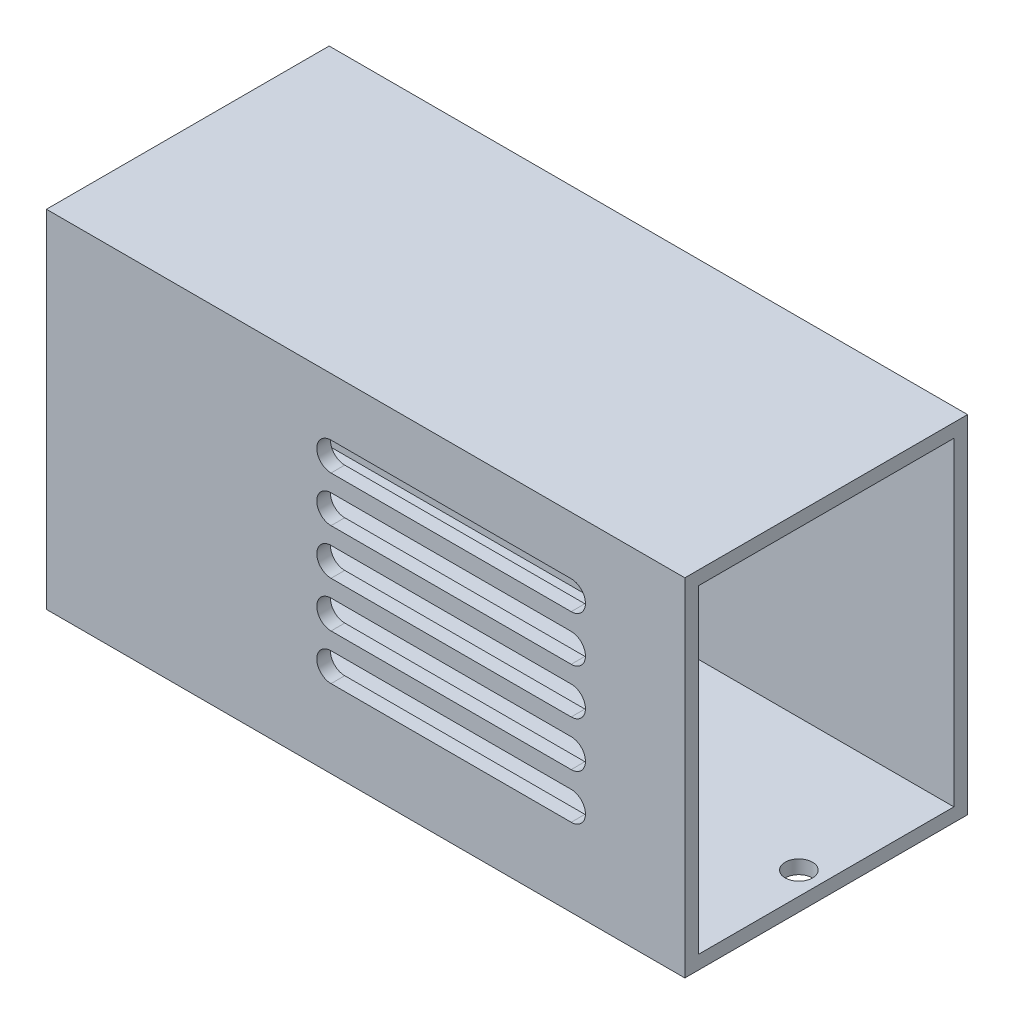
ISO-10303-21;
HEADER;
FILE_DESCRIPTION(('STEP AP214'),'2;1');
FILE_NAME('part.step','',(''),(''),'','','');
FILE_SCHEMA(('AUTOMOTIVE_DESIGN { 1 0 10303 214 1 1 1 1 }'));
ENDSEC;
DATA;
#1=APPLICATION_CONTEXT('core data for automotive mechanical design processes');
#2=APPLICATION_PROTOCOL_DEFINITION('international standard','automotive_design',2000,#1);
#3=PRODUCT_CONTEXT('',#1,'mechanical');
#4=PRODUCT('Part','Part','',(#3));
#5=PRODUCT_RELATED_PRODUCT_CATEGORY('part','',(#4));
#6=PRODUCT_DEFINITION_FORMATION('','',#4);
#7=PRODUCT_DEFINITION_CONTEXT('part definition',#1,'design');
#8=PRODUCT_DEFINITION('design','',#6,#7);
#9=PRODUCT_DEFINITION_SHAPE('','',#8);
#10=(LENGTH_UNIT() NAMED_UNIT(*) SI_UNIT(.MILLI.,.METRE.));
#11=(NAMED_UNIT(*) PLANE_ANGLE_UNIT() SI_UNIT($,.RADIAN.));
#12=(NAMED_UNIT(*) SI_UNIT($,.STERADIAN.) SOLID_ANGLE_UNIT());
#13=UNCERTAINTY_MEASURE_WITH_UNIT(LENGTH_MEASURE(1.E-05),#10,'distance_accuracy_value','');
#14=(GEOMETRIC_REPRESENTATION_CONTEXT(3) GLOBAL_UNCERTAINTY_ASSIGNED_CONTEXT((#13)) GLOBAL_UNIT_ASSIGNED_CONTEXT((#10,
#11,#12)) REPRESENTATION_CONTEXT('',''));
#15=CARTESIAN_POINT('',(0.,0.,0.));
#16=DIRECTION('',(0.,0.,1.));
#17=DIRECTION('',(1.,0.,0.));
#18=AXIS2_PLACEMENT_3D('',#15,#16,#17);
#19=CARTESIAN_POINT('',(35.,19.,31.));
#20=DIRECTION('',(-1.,0.,0.));
#21=DIRECTION('',(0.,0.,1.));
#22=AXIS2_PLACEMENT_3D('',#19,#20,#21);
#23=PLANE('',#22);
#24=DIRECTION('',(0.,0.,1.));
#25=VECTOR('',#24,1.);
#26=CARTESIAN_POINT('',(35.,17.5,29.5));
#27=LINE('',#26,#25);
#28=CARTESIAN_POINT('',(35.,17.5,1.5));
#29=VERTEX_POINT('',#28);
#30=CARTESIAN_POINT('',(35.,17.5,29.5));
#31=VERTEX_POINT('',#30);
#32=EDGE_CURVE('E347',#29,#31,#27,.T.);
#33=ORIENTED_EDGE('',*,*,#32,.F.);
#34=DIRECTION('',(0.,1.,0.));
#35=VECTOR('',#34,1.);
#36=CARTESIAN_POINT('',(35.,17.5,1.5));
#37=LINE('',#36,#35);
#38=CARTESIAN_POINT('',(35.,-17.5,1.5));
#39=VERTEX_POINT('',#38);
#40=EDGE_CURVE('E251',#39,#29,#37,.T.);
#41=ORIENTED_EDGE('',*,*,#40,.F.);
#42=DIRECTION('',(0.,0.,-1.));
#43=VECTOR('',#42,1.);
#44=CARTESIAN_POINT('',(35.,-17.5,29.5));
#45=LINE('',#44,#43);
#46=CARTESIAN_POINT('',(35.,-17.5,29.5));
#47=VERTEX_POINT('',#46);
#48=EDGE_CURVE('E336',#47,#39,#45,.T.);
#49=ORIENTED_EDGE('',*,*,#48,.F.);
#50=DIRECTION('',(0.,-1.,0.));
#51=VECTOR('',#50,1.);
#52=CARTESIAN_POINT('',(35.,17.5,29.5));
#53=LINE('',#52,#51);
#54=EDGE_CURVE('E350',#31,#47,#53,.T.);
#55=ORIENTED_EDGE('',*,*,#54,.F.);
#56=EDGE_LOOP('',(#33,#41,#49,#55));
#57=FACE_BOUND('',#56,.T.);
#58=DIRECTION('',(0.,1.,0.));
#59=VECTOR('',#58,1.);
#60=CARTESIAN_POINT('',(35.,19.,0.));
#61=LINE('',#60,#59);
#62=CARTESIAN_POINT('',(35.,-19.,0.));
#63=VERTEX_POINT('',#62);
#64=CARTESIAN_POINT('',(35.,19.,0.));
#65=VERTEX_POINT('',#64);
#66=EDGE_CURVE('E357',#63,#65,#61,.T.);
#67=ORIENTED_EDGE('',*,*,#66,.T.);
#68=DIRECTION('',(0.,0.,-1.));
#69=VECTOR('',#68,1.);
#70=CARTESIAN_POINT('',(35.,19.,31.));
#71=LINE('',#70,#69);
#72=CARTESIAN_POINT('',(35.,19.,31.));
#73=VERTEX_POINT('',#72);
#74=EDGE_CURVE('E390',#73,#65,#71,.T.);
#75=ORIENTED_EDGE('',*,*,#74,.F.);
#76=DIRECTION('',(0.,1.,0.));
#77=VECTOR('',#76,1.);
#78=CARTESIAN_POINT('',(35.,19.,31.));
#79=LINE('',#78,#77);
#80=CARTESIAN_POINT('',(35.,-19.,31.));
#81=VERTEX_POINT('',#80);
#82=EDGE_CURVE('E364',#81,#73,#79,.T.);
#83=ORIENTED_EDGE('',*,*,#82,.F.);
#84=DIRECTION('',(0.,0.,-1.));
#85=VECTOR('',#84,1.);
#86=CARTESIAN_POINT('',(35.,-19.,31.));
#87=LINE('',#86,#85);
#88=EDGE_CURVE('E374',#81,#63,#87,.T.);
#89=ORIENTED_EDGE('',*,*,#88,.T.);
#90=EDGE_LOOP('',(#67,#75,#83,#89));
#91=FACE_BOUND('',#90,.T.);
#92=ADVANCED_FACE('F34',(#57,#91),#23,.F.);
#93=CARTESIAN_POINT('',(-35.,19.,31.));
#94=DIRECTION('',(0.,-1.,0.));
#95=DIRECTION('',(0.,0.,-1.));
#96=AXIS2_PLACEMENT_3D('',#93,#94,#95);
#97=PLANE('',#96);
#98=DIRECTION('',(-1.,0.,0.));
#99=VECTOR('',#98,1.);
#100=CARTESIAN_POINT('',(-35.,19.,0.));
#101=LINE('',#100,#99);
#102=CARTESIAN_POINT('',(-35.,19.,0.));
#103=VERTEX_POINT('',#102);
#104=EDGE_CURVE('E377',#65,#103,#101,.T.);
#105=ORIENTED_EDGE('',*,*,#104,.T.);
#106=DIRECTION('',(0.,0.,-1.));
#107=VECTOR('',#106,1.);
#108=CARTESIAN_POINT('',(-35.,19.,31.));
#109=LINE('',#108,#107);
#110=CARTESIAN_POINT('',(-35.,19.,31.));
#111=VERTEX_POINT('',#110);
#112=EDGE_CURVE('E387',#111,#103,#109,.T.);
#113=ORIENTED_EDGE('',*,*,#112,.F.);
#114=DIRECTION('',(-1.,0.,0.));
#115=VECTOR('',#114,1.);
#116=CARTESIAN_POINT('',(-35.,19.,31.));
#117=LINE('',#116,#115);
#118=EDGE_CURVE('E367',#73,#111,#117,.T.);
#119=ORIENTED_EDGE('',*,*,#118,.F.);
#120=ORIENTED_EDGE('',*,*,#74,.T.);
#121=EDGE_LOOP('',(#105,#113,#119,#120));
#122=FACE_BOUND('',#121,.T.);
#123=ADVANCED_FACE('F482',(#122),#97,.F.);
#124=CARTESIAN_POINT('',(-35.,19.,31.));
#125=DIRECTION('',(1.,0.,0.));
#126=DIRECTION('',(0.,0.,-1.));
#127=AXIS2_PLACEMENT_3D('',#124,#125,#126);
#128=PLANE('',#127);
#129=DIRECTION('',(0.,0.,-1.));
#130=VECTOR('',#129,1.);
#131=CARTESIAN_POINT('',(-35.,-17.5,29.5));
#132=LINE('',#131,#130);
#133=CARTESIAN_POINT('',(-35.,-17.5,29.5));
#134=VERTEX_POINT('',#133);
#135=CARTESIAN_POINT('',(-35.,-17.5,1.5));
#136=VERTEX_POINT('',#135);
#137=EDGE_CURVE('E342',#134,#136,#132,.T.);
#138=ORIENTED_EDGE('',*,*,#137,.T.);
#139=DIRECTION('',(0.,1.,0.));
#140=VECTOR('',#139,1.);
#141=CARTESIAN_POINT('',(-35.,17.5,1.5));
#142=LINE('',#141,#140);
#143=CARTESIAN_POINT('',(-35.,17.5,1.5));
#144=VERTEX_POINT('',#143);
#145=EDGE_CURVE('E332',#136,#144,#142,.T.);
#146=ORIENTED_EDGE('',*,*,#145,.T.);
#147=DIRECTION('',(0.,0.,1.));
#148=VECTOR('',#147,1.);
#149=CARTESIAN_POINT('',(-35.,17.5,29.5));
#150=LINE('',#149,#148);
#151=CARTESIAN_POINT('',(-35.,17.5,29.5));
#152=VERTEX_POINT('',#151);
#153=EDGE_CURVE('E335',#144,#152,#150,.T.);
#154=ORIENTED_EDGE('',*,*,#153,.T.);
#155=DIRECTION('',(0.,-1.,0.));
#156=VECTOR('',#155,1.);
#157=CARTESIAN_POINT('',(-35.,17.5,29.5));
#158=LINE('',#157,#156);
#159=EDGE_CURVE('E339',#152,#134,#158,.T.);
#160=ORIENTED_EDGE('',*,*,#159,.T.);
#161=EDGE_LOOP('',(#138,#146,#154,#160));
#162=FACE_BOUND('',#161,.T.);
#163=DIRECTION('',(0.,-1.,0.));
#164=VECTOR('',#163,1.);
#165=CARTESIAN_POINT('',(-35.,19.,0.));
#166=LINE('',#165,#164);
#167=CARTESIAN_POINT('',(-35.,-19.,0.));
#168=VERTEX_POINT('',#167);
#169=EDGE_CURVE('E379',#103,#168,#166,.T.);
#170=ORIENTED_EDGE('',*,*,#169,.T.);
#171=DIRECTION('',(0.,0.,-1.));
#172=VECTOR('',#171,1.);
#173=CARTESIAN_POINT('',(-35.,-19.,31.));
#174=LINE('',#173,#172);
#175=CARTESIAN_POINT('',(-35.,-19.,31.));
#176=VERTEX_POINT('',#175);
#177=EDGE_CURVE('E384',#176,#168,#174,.T.);
#178=ORIENTED_EDGE('',*,*,#177,.F.);
#179=DIRECTION('',(0.,-1.,0.));
#180=VECTOR('',#179,1.);
#181=CARTESIAN_POINT('',(-35.,19.,31.));
#182=LINE('',#181,#180);
#183=EDGE_CURVE('E370',#111,#176,#182,.T.);
#184=ORIENTED_EDGE('',*,*,#183,.F.);
#185=ORIENTED_EDGE('',*,*,#112,.T.);
#186=EDGE_LOOP('',(#170,#178,#184,#185));
#187=FACE_BOUND('',#186,.T.);
#188=ADVANCED_FACE('F466',(#162,#187),#128,.F.);
#189=CARTESIAN_POINT('',(-35.,-19.,31.));
#190=DIRECTION('',(0.,1.,0.));
#191=DIRECTION('',(0.,0.,1.));
#192=AXIS2_PLACEMENT_3D('',#189,#190,#191);
#193=PLANE('',#192);
#194=CARTESIAN_POINT('',(-32.5,-19.,16.));
#195=DIRECTION('',(0.,-1.,0.));
#196=DIRECTION('',(0.,0.,-1.));
#197=AXIS2_PLACEMENT_3D('',#194,#195,#196);
#198=CIRCLE('',#197,1.5);
#199=CARTESIAN_POINT('',(-32.5,-19.,14.5));
#200=VERTEX_POINT('',#199);
#201=EDGE_CURVE('E447',#200,#200,#198,.T.);
#202=ORIENTED_EDGE('',*,*,#201,.F.);
#203=EDGE_LOOP('',(#202));
#204=FACE_BOUND('',#203,.T.);
#205=CARTESIAN_POINT('',(32.5,-19.,16.));
#206=DIRECTION('',(0.,-1.,0.));
#207=DIRECTION('',(0.,0.,-1.));
#208=AXIS2_PLACEMENT_3D('',#205,#206,#207);
#209=CIRCLE('',#208,1.5);
#210=CARTESIAN_POINT('',(32.5,-19.,14.5));
#211=VERTEX_POINT('',#210);
#212=EDGE_CURVE('E452',#211,#211,#209,.T.);
#213=ORIENTED_EDGE('',*,*,#212,.F.);
#214=EDGE_LOOP('',(#213));
#215=FACE_BOUND('',#214,.T.);
#216=DIRECTION('',(1.,0.,0.));
#217=VECTOR('',#216,1.);
#218=CARTESIAN_POINT('',(-35.,-19.,0.));
#219=LINE('',#218,#217);
#220=EDGE_CURVE('E368',#168,#63,#219,.T.);
#221=ORIENTED_EDGE('',*,*,#220,.T.);
#222=ORIENTED_EDGE('',*,*,#88,.F.);
#223=DIRECTION('',(1.,0.,0.));
#224=VECTOR('',#223,1.);
#225=CARTESIAN_POINT('',(-35.,-19.,31.));
#226=LINE('',#225,#224);
#227=EDGE_CURVE('E372',#176,#81,#226,.T.);
#228=ORIENTED_EDGE('',*,*,#227,.F.);
#229=ORIENTED_EDGE('',*,*,#177,.T.);
#230=EDGE_LOOP('',(#221,#222,#228,#229));
#231=FACE_BOUND('',#230,.T.);
#232=ADVANCED_FACE('F463',(#204,#215,#231),#193,.F.);
#233=CARTESIAN_POINT('',(0.,0.,31.));
#234=DIRECTION('',(0.,0.,1.));
#235=DIRECTION('',(1.,0.,0.));
#236=AXIS2_PLACEMENT_3D('',#233,#234,#235);
#237=PLANE('',#236);
#238=CARTESIAN_POINT('',(-3.79351902215155,11.1202175257189,31.));
#239=DIRECTION('',(0.,0.,1.));
#240=DIRECTION('',(1.,0.,0.));
#241=AXIS2_PLACEMENT_3D('',#238,#239,#240);
#242=CIRCLE('',#241,1.56203724441535);
#243=CARTESIAN_POINT('',(-3.79351902215155,12.6822547701342,31.));
#244=VERTEX_POINT('',#243);
#245=CARTESIAN_POINT('',(-3.79351902215155,9.55818028130355,31.));
#246=VERTEX_POINT('',#245);
#247=EDGE_CURVE('E50',#244,#246,#242,.T.);
#248=ORIENTED_EDGE('',*,*,#247,.F.);
#249=DIRECTION('',(-1.,0.,0.));
#250=VECTOR('',#249,1.);
#251=CARTESIAN_POINT('',(-3.79351902215155,12.6822547701342,31.));
#252=LINE('',#251,#250);
#253=CARTESIAN_POINT('',(22.5379659551357,12.6822547701342,31.));
#254=VERTEX_POINT('',#253);
#255=EDGE_CURVE('E244',#254,#244,#252,.T.);
#256=ORIENTED_EDGE('',*,*,#255,.F.);
#257=CARTESIAN_POINT('',(22.5379659551357,11.1202175257189,31.));
#258=DIRECTION('',(0.,0.,1.));
#259=DIRECTION('',(1.,0.,0.));
#260=AXIS2_PLACEMENT_3D('',#257,#258,#259);
#261=CIRCLE('',#260,1.56203724441535);
#262=CARTESIAN_POINT('',(22.5379659551357,9.55818028130355,31.));
#263=VERTEX_POINT('',#262);
#264=EDGE_CURVE('E227',#263,#254,#261,.T.);
#265=ORIENTED_EDGE('',*,*,#264,.F.);
#266=DIRECTION('',(1.,0.,0.));
#267=VECTOR('',#266,1.);
#268=CARTESIAN_POINT('',(-3.79351902215155,9.55818028130355,31.));
#269=LINE('',#268,#267);
#270=EDGE_CURVE('E237',#246,#263,#269,.T.);
#271=ORIENTED_EDGE('',*,*,#270,.F.);
#272=EDGE_LOOP('',(#248,#256,#265,#271));
#273=FACE_BOUND('',#272,.T.);
#274=CARTESIAN_POINT('',(-3.7935190221515,6.1202175257189,31.));
#275=DIRECTION('',(0.,0.,1.));
#276=DIRECTION('',(1.,0.,0.));
#277=AXIS2_PLACEMENT_3D('',#274,#275,#276);
#278=CIRCLE('',#277,1.56203724441535);
#279=CARTESIAN_POINT('',(-3.7935190221515,7.68225477013425,31.));
#280=VERTEX_POINT('',#279);
#281=CARTESIAN_POINT('',(-3.7935190221515,4.55818028130355,31.));
#282=VERTEX_POINT('',#281);
#283=EDGE_CURVE('E58',#280,#282,#278,.T.);
#284=ORIENTED_EDGE('',*,*,#283,.F.);
#285=DIRECTION('',(-1.,0.,0.));
#286=VECTOR('',#285,1.);
#287=CARTESIAN_POINT('',(-3.7935190221515,7.68225477013425,31.));
#288=LINE('',#287,#286);
#289=CARTESIAN_POINT('',(22.5379659551358,7.68225477013425,31.));
#290=VERTEX_POINT('',#289);
#291=EDGE_CURVE('E262',#290,#280,#288,.T.);
#292=ORIENTED_EDGE('',*,*,#291,.F.);
#293=CARTESIAN_POINT('',(22.5379659551358,6.1202175257189,31.));
#294=DIRECTION('',(0.,0.,1.));
#295=DIRECTION('',(1.,0.,0.));
#296=AXIS2_PLACEMENT_3D('',#293,#294,#295);
#297=CIRCLE('',#296,1.56203724441535);
#298=CARTESIAN_POINT('',(22.5379659551358,4.55818028130355,31.));
#299=VERTEX_POINT('',#298);
#300=EDGE_CURVE('E259',#299,#290,#297,.T.);
#301=ORIENTED_EDGE('',*,*,#300,.F.);
#302=DIRECTION('',(1.,0.,0.));
#303=VECTOR('',#302,1.);
#304=CARTESIAN_POINT('',(-3.7935190221515,4.55818028130355,31.));
#305=LINE('',#304,#303);
#306=EDGE_CURVE('E255',#282,#299,#305,.T.);
#307=ORIENTED_EDGE('',*,*,#306,.F.);
#308=EDGE_LOOP('',(#284,#292,#301,#307));
#309=FACE_BOUND('',#308,.T.);
#310=CARTESIAN_POINT('',(-3.79351902215145,1.1202175257189,31.));
#311=DIRECTION('',(0.,0.,1.));
#312=DIRECTION('',(1.,0.,0.));
#313=AXIS2_PLACEMENT_3D('',#310,#311,#312);
#314=CIRCLE('',#313,1.56203724441535);
#315=CARTESIAN_POINT('',(-3.79351902215145,2.68225477013425,31.));
#316=VERTEX_POINT('',#315);
#317=CARTESIAN_POINT('',(-3.79351902215145,-0.441819718696449,31.));
#318=VERTEX_POINT('',#317);
#319=EDGE_CURVE('E273',#316,#318,#314,.T.);
#320=ORIENTED_EDGE('',*,*,#319,.F.);
#321=DIRECTION('',(-1.,0.,0.));
#322=VECTOR('',#321,1.);
#323=CARTESIAN_POINT('',(-3.79351902215145,2.68225477013425,31.));
#324=LINE('',#323,#322);
#325=CARTESIAN_POINT('',(22.5379659551358,2.68225477013425,31.));
#326=VERTEX_POINT('',#325);
#327=EDGE_CURVE('E282',#326,#316,#324,.T.);
#328=ORIENTED_EDGE('',*,*,#327,.F.);
#329=CARTESIAN_POINT('',(22.5379659551358,1.1202175257189,31.));
#330=DIRECTION('',(0.,0.,1.));
#331=DIRECTION('',(1.,0.,0.));
#332=AXIS2_PLACEMENT_3D('',#329,#330,#331);
#333=CIRCLE('',#332,1.56203724441535);
#334=CARTESIAN_POINT('',(22.5379659551358,-0.441819718696449,31.));
#335=VERTEX_POINT('',#334);
#336=EDGE_CURVE('E279',#335,#326,#333,.T.);
#337=ORIENTED_EDGE('',*,*,#336,.F.);
#338=DIRECTION('',(1.,0.,0.));
#339=VECTOR('',#338,1.);
#340=CARTESIAN_POINT('',(-3.79351902215145,-0.441819718696449,31.));
#341=LINE('',#340,#339);
#342=EDGE_CURVE('E275',#318,#335,#341,.T.);
#343=ORIENTED_EDGE('',*,*,#342,.F.);
#344=EDGE_LOOP('',(#320,#328,#337,#343));
#345=FACE_BOUND('',#344,.T.);
#346=CARTESIAN_POINT('',(-3.7935190221514,-3.8797824742811,31.));
#347=DIRECTION('',(0.,0.,1.));
#348=DIRECTION('',(1.,0.,0.));
#349=AXIS2_PLACEMENT_3D('',#346,#347,#348);
#350=CIRCLE('',#349,1.56203724441535);
#351=CARTESIAN_POINT('',(-3.7935190221514,-2.31774522986575,31.));
#352=VERTEX_POINT('',#351);
#353=CARTESIAN_POINT('',(-3.7935190221514,-5.44181971869645,31.));
#354=VERTEX_POINT('',#353);
#355=EDGE_CURVE('E293',#352,#354,#350,.T.);
#356=ORIENTED_EDGE('',*,*,#355,.F.);
#357=DIRECTION('',(-1.,0.,0.));
#358=VECTOR('',#357,1.);
#359=CARTESIAN_POINT('',(-3.7935190221514,-2.31774522986575,31.));
#360=LINE('',#359,#358);
#361=CARTESIAN_POINT('',(22.5379659551359,-2.31774522986575,31.));
#362=VERTEX_POINT('',#361);
#363=EDGE_CURVE('E302',#362,#352,#360,.T.);
#364=ORIENTED_EDGE('',*,*,#363,.F.);
#365=CARTESIAN_POINT('',(22.5379659551359,-3.8797824742811,31.));
#366=DIRECTION('',(0.,0.,1.));
#367=DIRECTION('',(1.,0.,0.));
#368=AXIS2_PLACEMENT_3D('',#365,#366,#367);
#369=CIRCLE('',#368,1.56203724441535);
#370=CARTESIAN_POINT('',(22.5379659551359,-5.44181971869645,31.));
#371=VERTEX_POINT('',#370);
#372=EDGE_CURVE('E299',#371,#362,#369,.T.);
#373=ORIENTED_EDGE('',*,*,#372,.F.);
#374=DIRECTION('',(1.,0.,0.));
#375=VECTOR('',#374,1.);
#376=CARTESIAN_POINT('',(-3.7935190221514,-5.44181971869645,31.));
#377=LINE('',#376,#375);
#378=EDGE_CURVE('E295',#354,#371,#377,.T.);
#379=ORIENTED_EDGE('',*,*,#378,.F.);
#380=EDGE_LOOP('',(#356,#364,#373,#379));
#381=FACE_BOUND('',#380,.T.);
#382=CARTESIAN_POINT('',(-3.79351902215135,-8.8797824742811,31.));
#383=DIRECTION('',(0.,0.,1.));
#384=DIRECTION('',(1.,0.,0.));
#385=AXIS2_PLACEMENT_3D('',#382,#383,#384);
#386=CIRCLE('',#385,1.56203724441535);
#387=CARTESIAN_POINT('',(-3.79351902215135,-7.31774522986575,31.));
#388=VERTEX_POINT('',#387);
#389=CARTESIAN_POINT('',(-3.79351902215135,-10.4418197186964,31.));
#390=VERTEX_POINT('',#389);
#391=EDGE_CURVE('E313',#388,#390,#386,.T.);
#392=ORIENTED_EDGE('',*,*,#391,.F.);
#393=DIRECTION('',(-1.,0.,0.));
#394=VECTOR('',#393,1.);
#395=CARTESIAN_POINT('',(-3.79351902215135,-7.31774522986575,31.));
#396=LINE('',#395,#394);
#397=CARTESIAN_POINT('',(22.5379659551359,-7.31774522986575,31.));
#398=VERTEX_POINT('',#397);
#399=EDGE_CURVE('E321',#398,#388,#396,.T.);
#400=ORIENTED_EDGE('',*,*,#399,.F.);
#401=CARTESIAN_POINT('',(22.5379659551359,-8.8797824742811,31.));
#402=DIRECTION('',(0.,0.,1.));
#403=DIRECTION('',(1.,0.,0.));
#404=AXIS2_PLACEMENT_3D('',#401,#402,#403);
#405=CIRCLE('',#404,1.56203724441535);
#406=CARTESIAN_POINT('',(22.5379659551359,-10.4418197186964,31.));
#407=VERTEX_POINT('',#406);
#408=EDGE_CURVE('E318',#407,#398,#405,.T.);
#409=ORIENTED_EDGE('',*,*,#408,.F.);
#410=DIRECTION('',(1.,0.,0.));
#411=VECTOR('',#410,1.);
#412=CARTESIAN_POINT('',(-3.79351902215135,-10.4418197186964,31.));
#413=LINE('',#412,#411);
#414=EDGE_CURVE('E315',#390,#407,#413,.T.);
#415=ORIENTED_EDGE('',*,*,#414,.F.);
#416=EDGE_LOOP('',(#392,#400,#409,#415));
#417=FACE_BOUND('',#416,.T.);
#418=ORIENTED_EDGE('',*,*,#82,.T.);
#419=ORIENTED_EDGE('',*,*,#118,.T.);
#420=ORIENTED_EDGE('',*,*,#183,.T.);
#421=ORIENTED_EDGE('',*,*,#227,.T.);
#422=EDGE_LOOP('',(#418,#419,#420,#421));
#423=FACE_BOUND('',#422,.T.);
#424=ADVANCED_FACE('F241',(#273,#309,#345,#381,#417,#423),#237,.T.);
#425=CARTESIAN_POINT('',(0.,0.,0.));
#426=DIRECTION('',(0.,0.,1.));
#427=DIRECTION('',(1.,0.,0.));
#428=AXIS2_PLACEMENT_3D('',#425,#426,#427);
#429=PLANE('',#428);
#430=ORIENTED_EDGE('',*,*,#66,.F.);
#431=ORIENTED_EDGE('',*,*,#220,.F.);
#432=ORIENTED_EDGE('',*,*,#169,.F.);
#433=ORIENTED_EDGE('',*,*,#104,.F.);
#434=EDGE_LOOP('',(#430,#431,#432,#433));
#435=FACE_BOUND('',#434,.T.);
#436=ADVANCED_FACE('F479',(#435),#429,.F.);
#437=CARTESIAN_POINT('',(-35.,17.5,1.5));
#438=DIRECTION('',(0.,0.,-1.));
#439=DIRECTION('',(0.,1.,0.));
#440=AXIS2_PLACEMENT_3D('',#437,#438,#439);
#441=PLANE('',#440);
#442=ORIENTED_EDGE('',*,*,#40,.T.);
#443=DIRECTION('',(1.,0.,0.));
#444=VECTOR('',#443,1.);
#445=CARTESIAN_POINT('',(-35.,17.5,1.5));
#446=LINE('',#445,#444);
#447=EDGE_CURVE('E345',#144,#29,#446,.T.);
#448=ORIENTED_EDGE('',*,*,#447,.F.);
#449=ORIENTED_EDGE('',*,*,#145,.F.);
#450=DIRECTION('',(1.,0.,0.));
#451=VECTOR('',#450,1.);
#452=CARTESIAN_POINT('',(-35.,-17.5,1.5));
#453=LINE('',#452,#451);
#454=EDGE_CURVE('E355',#136,#39,#453,.T.);
#455=ORIENTED_EDGE('',*,*,#454,.T.);
#456=EDGE_LOOP('',(#442,#448,#449,#455));
#457=FACE_BOUND('',#456,.T.);
#458=ADVANCED_FACE('F506',(#457),#441,.F.);
#459=CARTESIAN_POINT('',(-35.,-17.5,29.5));
#460=DIRECTION('',(0.,-1.,0.));
#461=DIRECTION('',(0.,0.,-1.));
#462=AXIS2_PLACEMENT_3D('',#459,#460,#461);
#463=PLANE('',#462);
#464=CARTESIAN_POINT('',(-32.5,-17.5,16.));
#465=DIRECTION('',(0.,-1.,0.));
#466=DIRECTION('',(0.,0.,-1.));
#467=AXIS2_PLACEMENT_3D('',#464,#465,#466);
#468=CIRCLE('',#467,1.5);
#469=CARTESIAN_POINT('',(-32.5,-17.5,14.5));
#470=VERTEX_POINT('',#469);
#471=EDGE_CURVE('E37',#470,#470,#468,.T.);
#472=ORIENTED_EDGE('',*,*,#471,.T.);
#473=EDGE_LOOP('',(#472));
#474=FACE_BOUND('',#473,.T.);
#475=CARTESIAN_POINT('',(32.5,-17.5,16.));
#476=DIRECTION('',(0.,-1.,0.));
#477=DIRECTION('',(0.,0.,-1.));
#478=AXIS2_PLACEMENT_3D('',#475,#476,#477);
#479=CIRCLE('',#478,1.5);
#480=CARTESIAN_POINT('',(32.5,-17.5,14.5));
#481=VERTEX_POINT('',#480);
#482=EDGE_CURVE('E445',#481,#481,#479,.T.);
#483=ORIENTED_EDGE('',*,*,#482,.T.);
#484=EDGE_LOOP('',(#483));
#485=FACE_BOUND('',#484,.T.);
#486=ORIENTED_EDGE('',*,*,#48,.T.);
#487=ORIENTED_EDGE('',*,*,#454,.F.);
#488=ORIENTED_EDGE('',*,*,#137,.F.);
#489=DIRECTION('',(1.,0.,0.));
#490=VECTOR('',#489,1.);
#491=CARTESIAN_POINT('',(-35.,-17.5,29.5));
#492=LINE('',#491,#490);
#493=EDGE_CURVE('E358',#134,#47,#492,.T.);
#494=ORIENTED_EDGE('',*,*,#493,.T.);
#495=EDGE_LOOP('',(#486,#487,#488,#494));
#496=FACE_BOUND('',#495,.T.);
#497=ADVANCED_FACE('F509',(#474,#485,#496),#463,.F.);
#498=CARTESIAN_POINT('',(-35.,17.5,29.5));
#499=DIRECTION('',(0.,0.,1.));
#500=DIRECTION('',(0.,-1.,0.));
#501=AXIS2_PLACEMENT_3D('',#498,#499,#500);
#502=PLANE('',#501);
#503=DIRECTION('',(-1.,0.,0.));
#504=VECTOR('',#503,1.);
#505=CARTESIAN_POINT('',(-35.,12.6822547701342,29.5));
#506=LINE('',#505,#504);
#507=CARTESIAN_POINT('',(22.5379659551357,12.6822547701342,29.5));
#508=VERTEX_POINT('',#507);
#509=CARTESIAN_POINT('',(-3.79351902215155,12.6822547701342,29.5));
#510=VERTEX_POINT('',#509);
#511=EDGE_CURVE('E42',#508,#510,#506,.T.);
#512=ORIENTED_EDGE('',*,*,#511,.T.);
#513=CARTESIAN_POINT('',(-3.79351902215155,11.1202175257189,29.5));
#514=DIRECTION('',(0.,0.,1.));
#515=DIRECTION('',(0.,-1.,0.));
#516=AXIS2_PLACEMENT_3D('',#513,#514,#515);
#517=CIRCLE('',#516,1.56203724441535);
#518=CARTESIAN_POINT('',(-3.79351902215155,9.55818028130355,29.5));
#519=VERTEX_POINT('',#518);
#520=EDGE_CURVE('E11',#510,#519,#517,.T.);
#521=ORIENTED_EDGE('',*,*,#520,.T.);
#522=DIRECTION('',(1.,0.,0.));
#523=VECTOR('',#522,1.);
#524=CARTESIAN_POINT('',(-35.,9.55818028130355,29.5));
#525=LINE('',#524,#523);
#526=CARTESIAN_POINT('',(22.5379659551357,9.55818028130355,29.5));
#527=VERTEX_POINT('',#526);
#528=EDGE_CURVE('E441',#519,#527,#525,.T.);
#529=ORIENTED_EDGE('',*,*,#528,.T.);
#530=CARTESIAN_POINT('',(22.5379659551357,11.1202175257189,29.5));
#531=DIRECTION('',(0.,0.,1.));
#532=DIRECTION('',(0.,-1.,0.));
#533=AXIS2_PLACEMENT_3D('',#530,#531,#532);
#534=CIRCLE('',#533,1.56203724441535);
#535=EDGE_CURVE('E230',#527,#508,#534,.T.);
#536=ORIENTED_EDGE('',*,*,#535,.T.);
#537=EDGE_LOOP('',(#512,#521,#529,#536));
#538=FACE_BOUND('',#537,.T.);
#539=DIRECTION('',(-1.,0.,0.));
#540=VECTOR('',#539,1.);
#541=CARTESIAN_POINT('',(-35.,7.68225477013425,29.5));
#542=LINE('',#541,#540);
#543=CARTESIAN_POINT('',(22.5379659551358,7.68225477013425,29.5));
#544=VERTEX_POINT('',#543);
#545=CARTESIAN_POINT('',(-3.7935190221515,7.68225477013425,29.5));
#546=VERTEX_POINT('',#545);
#547=EDGE_CURVE('E435',#544,#546,#542,.T.);
#548=ORIENTED_EDGE('',*,*,#547,.T.);
#549=CARTESIAN_POINT('',(-3.7935190221515,6.1202175257189,29.5));
#550=DIRECTION('',(0.,0.,1.));
#551=DIRECTION('',(0.,-1.,0.));
#552=AXIS2_PLACEMENT_3D('',#549,#550,#551);
#553=CIRCLE('',#552,1.56203724441535);
#554=CARTESIAN_POINT('',(-3.7935190221515,4.55818028130355,29.5));
#555=VERTEX_POINT('',#554);
#556=EDGE_CURVE('E438',#546,#555,#553,.T.);
#557=ORIENTED_EDGE('',*,*,#556,.T.);
#558=DIRECTION('',(1.,0.,0.));
#559=VECTOR('',#558,1.);
#560=CARTESIAN_POINT('',(-35.,4.55818028130355,29.5));
#561=LINE('',#560,#559);
#562=CARTESIAN_POINT('',(22.5379659551358,4.55818028130355,29.5));
#563=VERTEX_POINT('',#562);
#564=EDGE_CURVE('E429',#555,#563,#561,.T.);
#565=ORIENTED_EDGE('',*,*,#564,.T.);
#566=CARTESIAN_POINT('',(22.5379659551358,6.1202175257189,29.5));
#567=DIRECTION('',(0.,0.,1.));
#568=DIRECTION('',(0.,-1.,0.));
#569=AXIS2_PLACEMENT_3D('',#566,#567,#568);
#570=CIRCLE('',#569,1.56203724441535);
#571=EDGE_CURVE('E432',#563,#544,#570,.T.);
#572=ORIENTED_EDGE('',*,*,#571,.T.);
#573=EDGE_LOOP('',(#548,#557,#565,#572));
#574=FACE_BOUND('',#573,.T.);
#575=DIRECTION('',(-1.,0.,0.));
#576=VECTOR('',#575,1.);
#577=CARTESIAN_POINT('',(-35.,2.68225477013425,29.5));
#578=LINE('',#577,#576);
#579=CARTESIAN_POINT('',(22.5379659551358,2.68225477013425,29.5));
#580=VERTEX_POINT('',#579);
#581=CARTESIAN_POINT('',(-3.79351902215145,2.68225477013425,29.5));
#582=VERTEX_POINT('',#581);
#583=EDGE_CURVE('E423',#580,#582,#578,.T.);
#584=ORIENTED_EDGE('',*,*,#583,.T.);
#585=CARTESIAN_POINT('',(-3.79351902215145,1.1202175257189,29.5));
#586=DIRECTION('',(0.,0.,1.));
#587=DIRECTION('',(0.,-1.,0.));
#588=AXIS2_PLACEMENT_3D('',#585,#586,#587);
#589=CIRCLE('',#588,1.56203724441535);
#590=CARTESIAN_POINT('',(-3.79351902215145,-0.441819718696449,29.5));
#591=VERTEX_POINT('',#590);
#592=EDGE_CURVE('E426',#582,#591,#589,.T.);
#593=ORIENTED_EDGE('',*,*,#592,.T.);
#594=DIRECTION('',(1.,0.,0.));
#595=VECTOR('',#594,1.);
#596=CARTESIAN_POINT('',(-35.,-0.441819718696449,29.5));
#597=LINE('',#596,#595);
#598=CARTESIAN_POINT('',(22.5379659551358,-0.441819718696449,29.5));
#599=VERTEX_POINT('',#598);
#600=EDGE_CURVE('E417',#591,#599,#597,.T.);
#601=ORIENTED_EDGE('',*,*,#600,.T.);
#602=CARTESIAN_POINT('',(22.5379659551358,1.1202175257189,29.5));
#603=DIRECTION('',(0.,0.,1.));
#604=DIRECTION('',(0.,-1.,0.));
#605=AXIS2_PLACEMENT_3D('',#602,#603,#604);
#606=CIRCLE('',#605,1.56203724441535);
#607=EDGE_CURVE('E420',#599,#580,#606,.T.);
#608=ORIENTED_EDGE('',*,*,#607,.T.);
#609=EDGE_LOOP('',(#584,#593,#601,#608));
#610=FACE_BOUND('',#609,.T.);
#611=DIRECTION('',(-1.,0.,0.));
#612=VECTOR('',#611,1.);
#613=CARTESIAN_POINT('',(-35.,-2.31774522986575,29.5));
#614=LINE('',#613,#612);
#615=CARTESIAN_POINT('',(22.5379659551359,-2.31774522986575,29.5));
#616=VERTEX_POINT('',#615);
#617=CARTESIAN_POINT('',(-3.7935190221514,-2.31774522986575,29.5));
#618=VERTEX_POINT('',#617);
#619=EDGE_CURVE('E411',#616,#618,#614,.T.);
#620=ORIENTED_EDGE('',*,*,#619,.T.);
#621=CARTESIAN_POINT('',(-3.7935190221514,-3.8797824742811,29.5));
#622=DIRECTION('',(0.,0.,1.));
#623=DIRECTION('',(0.,-1.,0.));
#624=AXIS2_PLACEMENT_3D('',#621,#622,#623);
#625=CIRCLE('',#624,1.56203724441535);
#626=CARTESIAN_POINT('',(-3.7935190221514,-5.44181971869645,29.5));
#627=VERTEX_POINT('',#626);
#628=EDGE_CURVE('E414',#618,#627,#625,.T.);
#629=ORIENTED_EDGE('',*,*,#628,.T.);
#630=DIRECTION('',(1.,0.,0.));
#631=VECTOR('',#630,1.);
#632=CARTESIAN_POINT('',(-35.,-5.44181971869645,29.5));
#633=LINE('',#632,#631);
#634=CARTESIAN_POINT('',(22.5379659551359,-5.44181971869645,29.5));
#635=VERTEX_POINT('',#634);
#636=EDGE_CURVE('E405',#627,#635,#633,.T.);
#637=ORIENTED_EDGE('',*,*,#636,.T.);
#638=CARTESIAN_POINT('',(22.5379659551359,-3.8797824742811,29.5));
#639=DIRECTION('',(0.,0.,1.));
#640=DIRECTION('',(0.,-1.,0.));
#641=AXIS2_PLACEMENT_3D('',#638,#639,#640);
#642=CIRCLE('',#641,1.56203724441535);
#643=EDGE_CURVE('E408',#635,#616,#642,.T.);
#644=ORIENTED_EDGE('',*,*,#643,.T.);
#645=EDGE_LOOP('',(#620,#629,#637,#644));
#646=FACE_BOUND('',#645,.T.);
#647=DIRECTION('',(-1.,0.,0.));
#648=VECTOR('',#647,1.);
#649=CARTESIAN_POINT('',(-35.,-7.31774522986576,29.5));
#650=LINE('',#649,#648);
#651=CARTESIAN_POINT('',(22.5379659551359,-7.31774522986575,29.5));
#652=VERTEX_POINT('',#651);
#653=CARTESIAN_POINT('',(-3.79351902215135,-7.31774522986575,29.5));
#654=VERTEX_POINT('',#653);
#655=EDGE_CURVE('E399',#652,#654,#650,.T.);
#656=ORIENTED_EDGE('',*,*,#655,.T.);
#657=CARTESIAN_POINT('',(-3.79351902215135,-8.8797824742811,29.5));
#658=DIRECTION('',(0.,0.,1.));
#659=DIRECTION('',(0.,-1.,0.));
#660=AXIS2_PLACEMENT_3D('',#657,#658,#659);
#661=CIRCLE('',#660,1.56203724441535);
#662=CARTESIAN_POINT('',(-3.79351902215135,-10.4418197186964,29.5));
#663=VERTEX_POINT('',#662);
#664=EDGE_CURVE('E402',#654,#663,#661,.T.);
#665=ORIENTED_EDGE('',*,*,#664,.T.);
#666=DIRECTION('',(1.,0.,0.));
#667=VECTOR('',#666,1.);
#668=CARTESIAN_POINT('',(-35.,-10.4418197186965,29.5));
#669=LINE('',#668,#667);
#670=CARTESIAN_POINT('',(22.5379659551359,-10.4418197186965,29.5));
#671=VERTEX_POINT('',#670);
#672=EDGE_CURVE('E393',#663,#671,#669,.T.);
#673=ORIENTED_EDGE('',*,*,#672,.T.);
#674=CARTESIAN_POINT('',(22.5379659551359,-8.8797824742811,29.5));
#675=DIRECTION('',(0.,0.,1.));
#676=DIRECTION('',(0.,-1.,0.));
#677=AXIS2_PLACEMENT_3D('',#674,#675,#676);
#678=CIRCLE('',#677,1.56203724441535);
#679=EDGE_CURVE('E396',#671,#652,#678,.T.);
#680=ORIENTED_EDGE('',*,*,#679,.T.);
#681=EDGE_LOOP('',(#656,#665,#673,#680));
#682=FACE_BOUND('',#681,.T.);
#683=ORIENTED_EDGE('',*,*,#54,.T.);
#684=ORIENTED_EDGE('',*,*,#493,.F.);
#685=ORIENTED_EDGE('',*,*,#159,.F.);
#686=DIRECTION('',(1.,0.,0.));
#687=VECTOR('',#686,1.);
#688=CARTESIAN_POINT('',(-35.,17.5,29.5));
#689=LINE('',#688,#687);
#690=EDGE_CURVE('E360',#152,#31,#689,.T.);
#691=ORIENTED_EDGE('',*,*,#690,.T.);
#692=EDGE_LOOP('',(#683,#684,#685,#691));
#693=FACE_BOUND('',#692,.T.);
#694=ADVANCED_FACE('F511',(#538,#574,#610,#646,#682,#693),#502,.F.);
#695=CARTESIAN_POINT('',(-35.,17.5,29.5));
#696=DIRECTION('',(0.,1.,0.));
#697=DIRECTION('',(0.,0.,1.));
#698=AXIS2_PLACEMENT_3D('',#695,#696,#697);
#699=PLANE('',#698);
#700=ORIENTED_EDGE('',*,*,#32,.T.);
#701=ORIENTED_EDGE('',*,*,#690,.F.);
#702=ORIENTED_EDGE('',*,*,#153,.F.);
#703=ORIENTED_EDGE('',*,*,#447,.T.);
#704=EDGE_LOOP('',(#700,#701,#702,#703));
#705=FACE_BOUND('',#704,.T.);
#706=ADVANCED_FACE('F502',(#705),#699,.F.);
#707=CARTESIAN_POINT('',(-3.79351902215135,-8.8797824742811,29.));
#708=DIRECTION('',(0.,0.,1.));
#709=DIRECTION('',(1.,0.,0.));
#710=AXIS2_PLACEMENT_3D('',#707,#708,#709);
#711=CYLINDRICAL_SURFACE('',#710,1.56203724441535);
#712=DIRECTION('',(0.,0.,1.));
#713=VECTOR('',#712,1.);
#714=CARTESIAN_POINT('',(-3.79351902215135,-7.31774522986575,29.));
#715=LINE('',#714,#713);
#716=EDGE_CURVE('E296',#654,#388,#715,.T.);
#717=ORIENTED_EDGE('',*,*,#716,.T.);
#718=ORIENTED_EDGE('',*,*,#391,.T.);
#719=DIRECTION('',(0.,0.,1.));
#720=VECTOR('',#719,1.);
#721=CARTESIAN_POINT('',(-3.79351902215135,-10.4418197186964,29.));
#722=LINE('',#721,#720);
#723=EDGE_CURVE('E324',#663,#390,#722,.T.);
#724=ORIENTED_EDGE('',*,*,#723,.F.);
#725=ORIENTED_EDGE('',*,*,#664,.F.);
#726=EDGE_LOOP('',(#717,#718,#724,#725));
#727=FACE_BOUND('',#726,.T.);
#728=ADVANCED_FACE('F519',(#727),#711,.F.);
#729=CARTESIAN_POINT('',(-3.79351902215135,-7.31774522986575,29.));
#730=DIRECTION('',(0.,1.,0.));
#731=DIRECTION('',(0.,0.,1.));
#732=AXIS2_PLACEMENT_3D('',#729,#730,#731);
#733=PLANE('',#732);
#734=DIRECTION('',(0.,0.,1.));
#735=VECTOR('',#734,1.);
#736=CARTESIAN_POINT('',(22.5379659551359,-7.31774522986575,29.));
#737=LINE('',#736,#735);
#738=EDGE_CURVE('E326',#652,#398,#737,.T.);
#739=ORIENTED_EDGE('',*,*,#738,.T.);
#740=ORIENTED_EDGE('',*,*,#399,.T.);
#741=ORIENTED_EDGE('',*,*,#716,.F.);
#742=ORIENTED_EDGE('',*,*,#655,.F.);
#743=EDGE_LOOP('',(#739,#740,#741,#742));
#744=FACE_BOUND('',#743,.T.);
#745=ADVANCED_FACE('F633',(#744),#733,.F.);
#746=CARTESIAN_POINT('',(22.5379659551359,-8.8797824742811,29.));
#747=DIRECTION('',(0.,0.,1.));
#748=DIRECTION('',(1.,0.,0.));
#749=AXIS2_PLACEMENT_3D('',#746,#747,#748);
#750=CYLINDRICAL_SURFACE('',#749,1.56203724441535);
#751=DIRECTION('',(0.,0.,1.));
#752=VECTOR('',#751,1.);
#753=CARTESIAN_POINT('',(22.5379659551359,-10.4418197186964,29.));
#754=LINE('',#753,#752);
#755=EDGE_CURVE('E328',#671,#407,#754,.T.);
#756=ORIENTED_EDGE('',*,*,#755,.T.);
#757=ORIENTED_EDGE('',*,*,#408,.T.);
#758=ORIENTED_EDGE('',*,*,#738,.F.);
#759=ORIENTED_EDGE('',*,*,#679,.F.);
#760=EDGE_LOOP('',(#756,#757,#758,#759));
#761=FACE_BOUND('',#760,.T.);
#762=ADVANCED_FACE('F636',(#761),#750,.F.);
#763=CARTESIAN_POINT('',(-3.79351902215135,-10.4418197186964,29.));
#764=DIRECTION('',(0.,-1.,0.));
#765=DIRECTION('',(0.,0.,-1.));
#766=AXIS2_PLACEMENT_3D('',#763,#764,#765);
#767=PLANE('',#766);
#768=ORIENTED_EDGE('',*,*,#723,.T.);
#769=ORIENTED_EDGE('',*,*,#414,.T.);
#770=ORIENTED_EDGE('',*,*,#755,.F.);
#771=ORIENTED_EDGE('',*,*,#672,.F.);
#772=EDGE_LOOP('',(#768,#769,#770,#771));
#773=FACE_BOUND('',#772,.T.);
#774=ADVANCED_FACE('F631',(#773),#767,.F.);
#775=CARTESIAN_POINT('',(-3.7935190221514,-3.8797824742811,29.));
#776=DIRECTION('',(0.,0.,1.));
#777=DIRECTION('',(1.,0.,0.));
#778=AXIS2_PLACEMENT_3D('',#775,#776,#777);
#779=CYLINDRICAL_SURFACE('',#778,1.56203724441535);
#780=DIRECTION('',(0.,0.,1.));
#781=VECTOR('',#780,1.);
#782=CARTESIAN_POINT('',(-3.7935190221514,-2.31774522986575,29.));
#783=LINE('',#782,#781);
#784=EDGE_CURVE('E276',#618,#352,#783,.T.);
#785=ORIENTED_EDGE('',*,*,#784,.T.);
#786=ORIENTED_EDGE('',*,*,#355,.T.);
#787=DIRECTION('',(0.,0.,1.));
#788=VECTOR('',#787,1.);
#789=CARTESIAN_POINT('',(-3.7935190221514,-5.44181971869645,29.));
#790=LINE('',#789,#788);
#791=EDGE_CURVE('E305',#627,#354,#790,.T.);
#792=ORIENTED_EDGE('',*,*,#791,.F.);
#793=ORIENTED_EDGE('',*,*,#628,.F.);
#794=EDGE_LOOP('',(#785,#786,#792,#793));
#795=FACE_BOUND('',#794,.T.);
#796=ADVANCED_FACE('F621',(#795),#779,.F.);
#797=CARTESIAN_POINT('',(-3.7935190221514,-2.31774522986575,29.));
#798=DIRECTION('',(0.,1.,0.));
#799=DIRECTION('',(0.,0.,1.));
#800=AXIS2_PLACEMENT_3D('',#797,#798,#799);
#801=PLANE('',#800);
#802=DIRECTION('',(0.,0.,1.));
#803=VECTOR('',#802,1.);
#804=CARTESIAN_POINT('',(22.5379659551359,-2.31774522986575,29.));
#805=LINE('',#804,#803);
#806=EDGE_CURVE('E307',#616,#362,#805,.T.);
#807=ORIENTED_EDGE('',*,*,#806,.T.);
#808=ORIENTED_EDGE('',*,*,#363,.T.);
#809=ORIENTED_EDGE('',*,*,#784,.F.);
#810=ORIENTED_EDGE('',*,*,#619,.F.);
#811=EDGE_LOOP('',(#807,#808,#809,#810));
#812=FACE_BOUND('',#811,.T.);
#813=ADVANCED_FACE('F617',(#812),#801,.F.);
#814=CARTESIAN_POINT('',(22.5379659551359,-3.8797824742811,29.));
#815=DIRECTION('',(0.,0.,1.));
#816=DIRECTION('',(1.,0.,0.));
#817=AXIS2_PLACEMENT_3D('',#814,#815,#816);
#818=CYLINDRICAL_SURFACE('',#817,1.56203724441535);
#819=DIRECTION('',(0.,0.,1.));
#820=VECTOR('',#819,1.);
#821=CARTESIAN_POINT('',(22.5379659551359,-5.44181971869645,29.));
#822=LINE('',#821,#820);
#823=EDGE_CURVE('E309',#635,#371,#822,.T.);
#824=ORIENTED_EDGE('',*,*,#823,.T.);
#825=ORIENTED_EDGE('',*,*,#372,.T.);
#826=ORIENTED_EDGE('',*,*,#806,.F.);
#827=ORIENTED_EDGE('',*,*,#643,.F.);
#828=EDGE_LOOP('',(#824,#825,#826,#827));
#829=FACE_BOUND('',#828,.T.);
#830=ADVANCED_FACE('F620',(#829),#818,.F.);
#831=CARTESIAN_POINT('',(-3.7935190221514,-5.44181971869645,29.));
#832=DIRECTION('',(0.,-1.,0.));
#833=DIRECTION('',(0.,0.,-1.));
#834=AXIS2_PLACEMENT_3D('',#831,#832,#833);
#835=PLANE('',#834);
#836=ORIENTED_EDGE('',*,*,#791,.T.);
#837=ORIENTED_EDGE('',*,*,#378,.T.);
#838=ORIENTED_EDGE('',*,*,#823,.F.);
#839=ORIENTED_EDGE('',*,*,#636,.F.);
#840=EDGE_LOOP('',(#836,#837,#838,#839));
#841=FACE_BOUND('',#840,.T.);
#842=ADVANCED_FACE('F615',(#841),#835,.F.);
#843=CARTESIAN_POINT('',(-3.79351902215145,1.1202175257189,29.));
#844=DIRECTION('',(0.,0.,1.));
#845=DIRECTION('',(1.,0.,0.));
#846=AXIS2_PLACEMENT_3D('',#843,#844,#845);
#847=CYLINDRICAL_SURFACE('',#846,1.56203724441535);
#848=DIRECTION('',(0.,0.,1.));
#849=VECTOR('',#848,1.);
#850=CARTESIAN_POINT('',(-3.79351902215145,2.68225477013425,29.));
#851=LINE('',#850,#849);
#852=EDGE_CURVE('E256',#582,#316,#851,.T.);
#853=ORIENTED_EDGE('',*,*,#852,.T.);
#854=ORIENTED_EDGE('',*,*,#319,.T.);
#855=DIRECTION('',(0.,0.,1.));
#856=VECTOR('',#855,1.);
#857=CARTESIAN_POINT('',(-3.79351902215145,-0.441819718696449,29.));
#858=LINE('',#857,#856);
#859=EDGE_CURVE('E285',#591,#318,#858,.T.);
#860=ORIENTED_EDGE('',*,*,#859,.F.);
#861=ORIENTED_EDGE('',*,*,#592,.F.);
#862=EDGE_LOOP('',(#853,#854,#860,#861));
#863=FACE_BOUND('',#862,.T.);
#864=ADVANCED_FACE('F605',(#863),#847,.F.);
#865=CARTESIAN_POINT('',(-3.79351902215145,2.68225477013425,29.));
#866=DIRECTION('',(0.,1.,0.));
#867=DIRECTION('',(0.,0.,1.));
#868=AXIS2_PLACEMENT_3D('',#865,#866,#867);
#869=PLANE('',#868);
#870=DIRECTION('',(0.,0.,1.));
#871=VECTOR('',#870,1.);
#872=CARTESIAN_POINT('',(22.5379659551358,2.68225477013425,29.));
#873=LINE('',#872,#871);
#874=EDGE_CURVE('E287',#580,#326,#873,.T.);
#875=ORIENTED_EDGE('',*,*,#874,.T.);
#876=ORIENTED_EDGE('',*,*,#327,.T.);
#877=ORIENTED_EDGE('',*,*,#852,.F.);
#878=ORIENTED_EDGE('',*,*,#583,.F.);
#879=EDGE_LOOP('',(#875,#876,#877,#878));
#880=FACE_BOUND('',#879,.T.);
#881=ADVANCED_FACE('F601',(#880),#869,.F.);
#882=CARTESIAN_POINT('',(22.5379659551358,1.1202175257189,29.));
#883=DIRECTION('',(0.,0.,1.));
#884=DIRECTION('',(1.,0.,0.));
#885=AXIS2_PLACEMENT_3D('',#882,#883,#884);
#886=CYLINDRICAL_SURFACE('',#885,1.56203724441535);
#887=DIRECTION('',(0.,0.,1.));
#888=VECTOR('',#887,1.);
#889=CARTESIAN_POINT('',(22.5379659551358,-0.441819718696449,29.));
#890=LINE('',#889,#888);
#891=EDGE_CURVE('E289',#599,#335,#890,.T.);
#892=ORIENTED_EDGE('',*,*,#891,.T.);
#893=ORIENTED_EDGE('',*,*,#336,.T.);
#894=ORIENTED_EDGE('',*,*,#874,.F.);
#895=ORIENTED_EDGE('',*,*,#607,.F.);
#896=EDGE_LOOP('',(#892,#893,#894,#895));
#897=FACE_BOUND('',#896,.T.);
#898=ADVANCED_FACE('F604',(#897),#886,.F.);
#899=CARTESIAN_POINT('',(-3.79351902215145,-0.441819718696449,29.));
#900=DIRECTION('',(0.,-1.,0.));
#901=DIRECTION('',(0.,0.,-1.));
#902=AXIS2_PLACEMENT_3D('',#899,#900,#901);
#903=PLANE('',#902);
#904=ORIENTED_EDGE('',*,*,#859,.T.);
#905=ORIENTED_EDGE('',*,*,#342,.T.);
#906=ORIENTED_EDGE('',*,*,#891,.F.);
#907=ORIENTED_EDGE('',*,*,#600,.F.);
#908=EDGE_LOOP('',(#904,#905,#906,#907));
#909=FACE_BOUND('',#908,.T.);
#910=ADVANCED_FACE('F600',(#909),#903,.F.);
#911=CARTESIAN_POINT('',(-3.7935190221515,6.1202175257189,29.));
#912=DIRECTION('',(0.,0.,1.));
#913=DIRECTION('',(1.,0.,0.));
#914=AXIS2_PLACEMENT_3D('',#911,#912,#913);
#915=CYLINDRICAL_SURFACE('',#914,1.56203724441535);
#916=DIRECTION('',(0.,0.,1.));
#917=VECTOR('',#916,1.);
#918=CARTESIAN_POINT('',(-3.7935190221515,7.68225477013425,29.));
#919=LINE('',#918,#917);
#920=EDGE_CURVE('E266',#546,#280,#919,.T.);
#921=ORIENTED_EDGE('',*,*,#920,.T.);
#922=ORIENTED_EDGE('',*,*,#283,.T.);
#923=DIRECTION('',(0.,0.,1.));
#924=VECTOR('',#923,1.);
#925=CARTESIAN_POINT('',(-3.7935190221515,4.55818028130355,29.));
#926=LINE('',#925,#924);
#927=EDGE_CURVE('E265',#555,#282,#926,.T.);
#928=ORIENTED_EDGE('',*,*,#927,.F.);
#929=ORIENTED_EDGE('',*,*,#556,.F.);
#930=EDGE_LOOP('',(#921,#922,#928,#929));
#931=FACE_BOUND('',#930,.T.);
#932=ADVANCED_FACE('F590',(#931),#915,.F.);
#933=CARTESIAN_POINT('',(-3.7935190221515,7.68225477013425,29.));
#934=DIRECTION('',(0.,1.,0.));
#935=DIRECTION('',(0.,0.,1.));
#936=AXIS2_PLACEMENT_3D('',#933,#934,#935);
#937=PLANE('',#936);
#938=DIRECTION('',(0.,0.,1.));
#939=VECTOR('',#938,1.);
#940=CARTESIAN_POINT('',(22.5379659551358,7.68225477013425,29.));
#941=LINE('',#940,#939);
#942=EDGE_CURVE('E268',#544,#290,#941,.T.);
#943=ORIENTED_EDGE('',*,*,#942,.T.);
#944=ORIENTED_EDGE('',*,*,#291,.T.);
#945=ORIENTED_EDGE('',*,*,#920,.F.);
#946=ORIENTED_EDGE('',*,*,#547,.F.);
#947=EDGE_LOOP('',(#943,#944,#945,#946));
#948=FACE_BOUND('',#947,.T.);
#949=ADVANCED_FACE('F586',(#948),#937,.F.);
#950=CARTESIAN_POINT('',(22.5379659551358,6.1202175257189,29.));
#951=DIRECTION('',(0.,0.,1.));
#952=DIRECTION('',(1.,0.,0.));
#953=AXIS2_PLACEMENT_3D('',#950,#951,#952);
#954=CYLINDRICAL_SURFACE('',#953,1.56203724441535);
#955=DIRECTION('',(0.,0.,1.));
#956=VECTOR('',#955,1.);
#957=CARTESIAN_POINT('',(22.5379659551358,4.55818028130355,29.));
#958=LINE('',#957,#956);
#959=EDGE_CURVE('E270',#563,#299,#958,.T.);
#960=ORIENTED_EDGE('',*,*,#959,.T.);
#961=ORIENTED_EDGE('',*,*,#300,.T.);
#962=ORIENTED_EDGE('',*,*,#942,.F.);
#963=ORIENTED_EDGE('',*,*,#571,.F.);
#964=EDGE_LOOP('',(#960,#961,#962,#963));
#965=FACE_BOUND('',#964,.T.);
#966=ADVANCED_FACE('F589',(#965),#954,.F.);
#967=CARTESIAN_POINT('',(-3.7935190221515,4.55818028130355,29.));
#968=DIRECTION('',(0.,-1.,0.));
#969=DIRECTION('',(0.,0.,-1.));
#970=AXIS2_PLACEMENT_3D('',#967,#968,#969);
#971=PLANE('',#970);
#972=ORIENTED_EDGE('',*,*,#927,.T.);
#973=ORIENTED_EDGE('',*,*,#306,.T.);
#974=ORIENTED_EDGE('',*,*,#959,.F.);
#975=ORIENTED_EDGE('',*,*,#564,.F.);
#976=EDGE_LOOP('',(#972,#973,#974,#975));
#977=FACE_BOUND('',#976,.T.);
#978=ADVANCED_FACE('F585',(#977),#971,.F.);
#979=CARTESIAN_POINT('',(-3.79351902215155,11.1202175257189,29.));
#980=DIRECTION('',(0.,0.,1.));
#981=DIRECTION('',(1.,0.,0.));
#982=AXIS2_PLACEMENT_3D('',#979,#980,#981);
#983=CYLINDRICAL_SURFACE('',#982,1.56203724441535);
#984=DIRECTION('',(0.,0.,1.));
#985=VECTOR('',#984,1.);
#986=CARTESIAN_POINT('',(-3.79351902215155,12.6822547701342,29.));
#987=LINE('',#986,#985);
#988=EDGE_CURVE('E249',#510,#244,#987,.T.);
#989=ORIENTED_EDGE('',*,*,#988,.T.);
#990=ORIENTED_EDGE('',*,*,#247,.T.);
#991=DIRECTION('',(0.,0.,1.));
#992=VECTOR('',#991,1.);
#993=CARTESIAN_POINT('',(-3.79351902215155,9.55818028130355,29.));
#994=LINE('',#993,#992);
#995=EDGE_CURVE('E234',#519,#246,#994,.T.);
#996=ORIENTED_EDGE('',*,*,#995,.F.);
#997=ORIENTED_EDGE('',*,*,#520,.F.);
#998=EDGE_LOOP('',(#989,#990,#996,#997));
#999=FACE_BOUND('',#998,.T.);
#1000=ADVANCED_FACE('F578',(#999),#983,.F.);
#1001=CARTESIAN_POINT('',(-3.79351902215155,12.6822547701342,29.));
#1002=DIRECTION('',(0.,1.,0.));
#1003=DIRECTION('',(0.,0.,1.));
#1004=AXIS2_PLACEMENT_3D('',#1001,#1002,#1003);
#1005=PLANE('',#1004);
#1006=DIRECTION('',(0.,0.,1.));
#1007=VECTOR('',#1006,1.);
#1008=CARTESIAN_POINT('',(22.5379659551357,12.6822547701342,29.));
#1009=LINE('',#1008,#1007);
#1010=EDGE_CURVE('E233',#508,#254,#1009,.T.);
#1011=ORIENTED_EDGE('',*,*,#1010,.T.);
#1012=ORIENTED_EDGE('',*,*,#255,.T.);
#1013=ORIENTED_EDGE('',*,*,#988,.F.);
#1014=ORIENTED_EDGE('',*,*,#511,.F.);
#1015=EDGE_LOOP('',(#1011,#1012,#1013,#1014));
#1016=FACE_BOUND('',#1015,.T.);
#1017=ADVANCED_FACE('F575',(#1016),#1005,.F.);
#1018=CARTESIAN_POINT('',(22.5379659551357,11.1202175257189,29.));
#1019=DIRECTION('',(0.,0.,1.));
#1020=DIRECTION('',(1.,0.,0.));
#1021=AXIS2_PLACEMENT_3D('',#1018,#1019,#1020);
#1022=CYLINDRICAL_SURFACE('',#1021,1.56203724441535);
#1023=DIRECTION('',(0.,0.,1.));
#1024=VECTOR('',#1023,1.);
#1025=CARTESIAN_POINT('',(22.5379659551357,9.55818028130355,29.));
#1026=LINE('',#1025,#1024);
#1027=EDGE_CURVE('E222',#527,#263,#1026,.T.);
#1028=ORIENTED_EDGE('',*,*,#1027,.T.);
#1029=ORIENTED_EDGE('',*,*,#264,.T.);
#1030=ORIENTED_EDGE('',*,*,#1010,.F.);
#1031=ORIENTED_EDGE('',*,*,#535,.F.);
#1032=EDGE_LOOP('',(#1028,#1029,#1030,#1031));
#1033=FACE_BOUND('',#1032,.T.);
#1034=ADVANCED_FACE('F224',(#1033),#1022,.F.);
#1035=CARTESIAN_POINT('',(-3.79351902215155,9.55818028130355,29.));
#1036=DIRECTION('',(0.,-1.,0.));
#1037=DIRECTION('',(0.,0.,-1.));
#1038=AXIS2_PLACEMENT_3D('',#1035,#1036,#1037);
#1039=PLANE('',#1038);
#1040=ORIENTED_EDGE('',*,*,#995,.T.);
#1041=ORIENTED_EDGE('',*,*,#270,.T.);
#1042=ORIENTED_EDGE('',*,*,#1027,.F.);
#1043=ORIENTED_EDGE('',*,*,#528,.F.);
#1044=EDGE_LOOP('',(#1040,#1041,#1042,#1043));
#1045=FACE_BOUND('',#1044,.T.);
#1046=ADVANCED_FACE('F238',(#1045),#1039,.F.);
#1047=CARTESIAN_POINT('',(32.5,-17.,16.));
#1048=DIRECTION('',(0.,-1.,0.));
#1049=DIRECTION('',(0.,0.,-1.));
#1050=AXIS2_PLACEMENT_3D('',#1047,#1048,#1049);
#1051=CYLINDRICAL_SURFACE('',#1050,1.5);
#1052=ORIENTED_EDGE('',*,*,#212,.T.);
#1053=EDGE_LOOP('',(#1052));
#1054=FACE_BOUND('',#1053,.T.);
#1055=ORIENTED_EDGE('',*,*,#482,.F.);
#1056=EDGE_LOOP('',(#1055));
#1057=FACE_BOUND('',#1056,.T.);
#1058=ADVANCED_FACE('F460',(#1054,#1057),#1051,.F.);
#1059=CARTESIAN_POINT('',(-32.5,-17.,16.));
#1060=DIRECTION('',(0.,-1.,0.));
#1061=DIRECTION('',(0.,0.,-1.));
#1062=AXIS2_PLACEMENT_3D('',#1059,#1060,#1061);
#1063=CYLINDRICAL_SURFACE('',#1062,1.5);
#1064=ORIENTED_EDGE('',*,*,#201,.T.);
#1065=EDGE_LOOP('',(#1064));
#1066=FACE_BOUND('',#1065,.T.);
#1067=ORIENTED_EDGE('',*,*,#471,.F.);
#1068=EDGE_LOOP('',(#1067));
#1069=FACE_BOUND('',#1068,.T.);
#1070=ADVANCED_FACE('F559',(#1066,#1069),#1063,.F.);
#1071=CLOSED_SHELL('',(#92,#123,#188,#232,#424,#436,#458,#497,#694,#706,#728,#745,#762,#774,
#796,#813,#830,#842,#864,#881,#898,#910,#932,#949,#966,#978,#1000,#1017,#1034,#1046,#1058,#1070));
#1072=MANIFOLD_SOLID_BREP('B2',#1071);
#1073=ADVANCED_BREP_SHAPE_REPRESENTATION('',(#18,#1072),#14);
#1074=SHAPE_DEFINITION_REPRESENTATION(#9,#1073);
ENDSEC;
END-ISO-10303-21;
